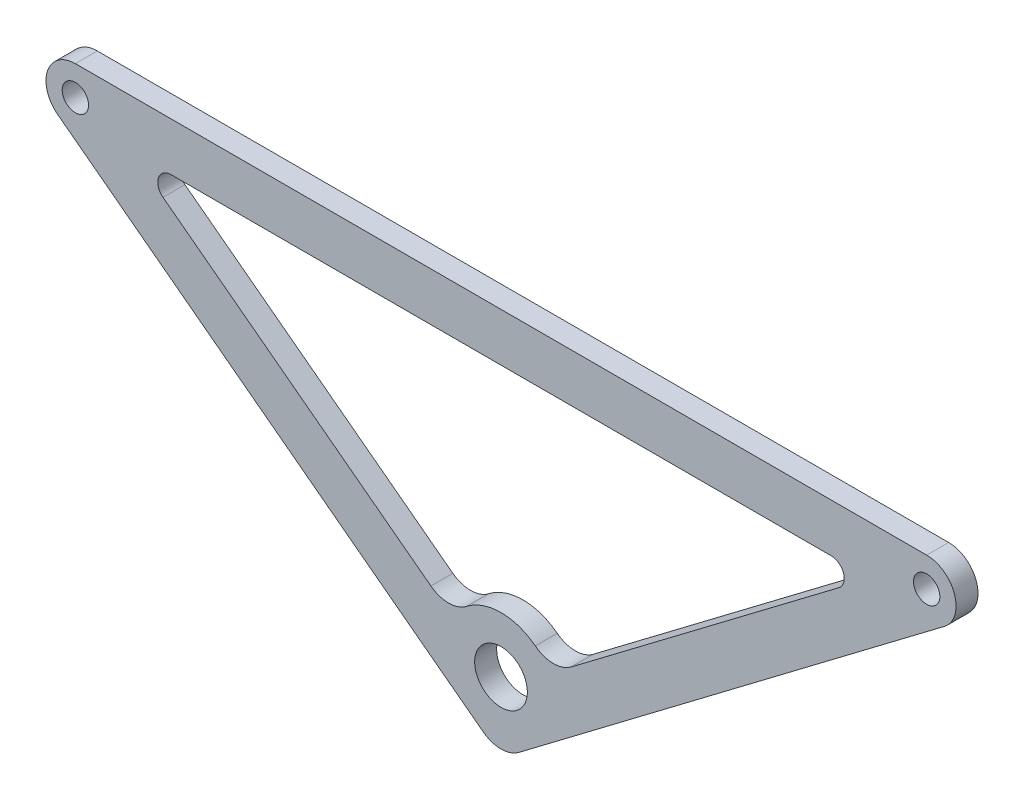
ISO-10303-21;
HEADER;
FILE_DESCRIPTION(('STEP AP214'),'2;1');
FILE_NAME('part.step','',(''),(''),'','','');
FILE_SCHEMA(('AUTOMOTIVE_DESIGN { 1 0 10303 214 1 1 1 1 }'));
ENDSEC;
DATA;
#1=APPLICATION_CONTEXT('core data for automotive mechanical design processes');
#2=APPLICATION_PROTOCOL_DEFINITION('international standard','automotive_design',2000,#1);
#3=PRODUCT_CONTEXT('',#1,'mechanical');
#4=PRODUCT('Part','Part','',(#3));
#5=PRODUCT_RELATED_PRODUCT_CATEGORY('part','',(#4));
#6=PRODUCT_DEFINITION_FORMATION('','',#4);
#7=PRODUCT_DEFINITION_CONTEXT('part definition',#1,'design');
#8=PRODUCT_DEFINITION('design','',#6,#7);
#9=PRODUCT_DEFINITION_SHAPE('','',#8);
#10=(LENGTH_UNIT() NAMED_UNIT(*) SI_UNIT(.MILLI.,.METRE.));
#11=(NAMED_UNIT(*) PLANE_ANGLE_UNIT() SI_UNIT($,.RADIAN.));
#12=(NAMED_UNIT(*) SI_UNIT($,.STERADIAN.) SOLID_ANGLE_UNIT());
#13=UNCERTAINTY_MEASURE_WITH_UNIT(LENGTH_MEASURE(1.E-05),#10,'distance_accuracy_value','');
#14=(GEOMETRIC_REPRESENTATION_CONTEXT(3) GLOBAL_UNCERTAINTY_ASSIGNED_CONTEXT((#13)) GLOBAL_UNIT_ASSIGNED_CONTEXT((#10,
#11,#12)) REPRESENTATION_CONTEXT('',''));
#15=CARTESIAN_POINT('',(0.,0.,0.));
#16=DIRECTION('',(0.,0.,1.));
#17=DIRECTION('',(1.,0.,0.));
#18=AXIS2_PLACEMENT_3D('',#15,#16,#17);
#19=CARTESIAN_POINT('',(0.,-80.,2.5));
#20=DIRECTION('',(0.,0.,1.));
#21=DIRECTION('',(1.,0.,0.));
#22=AXIS2_PLACEMENT_3D('',#19,#20,#21);
#23=PLANE('',#22);
#24=CARTESIAN_POINT('',(0.,-72.4768091251751,2.5));
#25=DIRECTION('',(0.,0.,-1.));
#26=DIRECTION('',(-1.,0.,0.));
#27=AXIS2_PLACEMENT_3D('',#24,#25,#26);
#28=CIRCLE('',#27,12.7);
#29=CARTESIAN_POINT('',(-7.80952551393194,-62.4617548943062,2.5));
#30=VERTEX_POINT('',#29);
#31=CARTESIAN_POINT('',(7.80952551393194,-62.4617548943062,2.5));
#32=VERTEX_POINT('',#31);
#33=EDGE_CURVE('E145',#30,#32,#28,.T.);
#34=ORIENTED_EDGE('',*,*,#33,.F.);
#35=CARTESIAN_POINT('',(-11.9295114149826,-57.1782223473123,2.5));
#36=DIRECTION('',(0.,0.,1.));
#37=DIRECTION('',(-1.,0.,0.));
#38=AXIS2_PLACEMENT_3D('',#35,#36,#37);
#39=CIRCLE('',#38,6.7);
#40=CARTESIAN_POINT('',(-15.9714478155139,-62.5216996920814,2.5));
#41=VERTEX_POINT('',#40);
#42=EDGE_CURVE('E137',#41,#30,#39,.T.);
#43=ORIENTED_EDGE('',*,*,#42,.F.);
#44=DIRECTION('',(0.797533932055083,-0.603274089631536,0.));
#45=VECTOR('',#44,1.);
#46=CARTESIAN_POINT('',(-76.9545423315636,-16.3926017961653,2.5));
#47=LINE('',#46,#45);
#48=CARTESIAN_POINT('',(-76.9545423315636,-16.3926017961653,2.5));
#49=VERTEX_POINT('',#48);
#50=EDGE_CURVE('E172',#49,#41,#47,.T.);
#51=ORIENTED_EDGE('',*,*,#50,.F.);
#52=CARTESIAN_POINT('',(-75.1447200626691,-14.,2.5));
#53=DIRECTION('',(0.,0.,1.));
#54=DIRECTION('',(1.,0.,0.));
#55=AXIS2_PLACEMENT_3D('',#52,#53,#54);
#56=CIRCLE('',#55,3.);
#57=CARTESIAN_POINT('',(-75.144720062669,-11.,2.5));
#58=VERTEX_POINT('',#57);
#59=EDGE_CURVE('E170',#58,#49,#56,.T.);
#60=ORIENTED_EDGE('',*,*,#59,.F.);
#61=DIRECTION('',(-1.,0.,0.));
#62=VECTOR('',#61,1.);
#63=CARTESIAN_POINT('',(75.144720062669,-11.,2.5));
#64=LINE('',#63,#62);
#65=CARTESIAN_POINT('',(75.144720062669,-11.,2.5));
#66=VERTEX_POINT('',#65);
#67=EDGE_CURVE('E168',#66,#58,#64,.T.);
#68=ORIENTED_EDGE('',*,*,#67,.F.);
#69=CARTESIAN_POINT('',(75.1447200626692,-14.,2.5));
#70=DIRECTION('',(0.,0.,1.));
#71=DIRECTION('',(-1.,0.,0.));
#72=AXIS2_PLACEMENT_3D('',#69,#70,#71);
#73=CIRCLE('',#72,3.);
#74=CARTESIAN_POINT('',(76.9545423315637,-16.3926017961653,2.5));
#75=VERTEX_POINT('',#74);
#76=EDGE_CURVE('E166',#75,#66,#73,.T.);
#77=ORIENTED_EDGE('',*,*,#76,.F.);
#78=DIRECTION('',(0.797533932055083,0.603274089631536,0.));
#79=VECTOR('',#78,1.);
#80=CARTESIAN_POINT('',(15.971447815514,-62.5216996920814,2.5));
#81=LINE('',#80,#79);
#82=CARTESIAN_POINT('',(15.971447815514,-62.5216996920814,2.5));
#83=VERTEX_POINT('',#82);
#84=EDGE_CURVE('E161',#83,#75,#81,.T.);
#85=ORIENTED_EDGE('',*,*,#84,.F.);
#86=CARTESIAN_POINT('',(11.9295114149827,-57.1782223473123,2.5));
#87=DIRECTION('',(0.,0.,1.));
#88=DIRECTION('',(1.,0.,0.));
#89=AXIS2_PLACEMENT_3D('',#86,#87,#88);
#90=CIRCLE('',#89,6.70000000000001);
#91=EDGE_CURVE('E159',#32,#83,#90,.T.);
#92=ORIENTED_EDGE('',*,*,#91,.F.);
#93=EDGE_LOOP('',(#34,#43,#51,#60,#68,#77,#85,#92));
#94=FACE_BOUND('',#93,.T.);
#95=CARTESIAN_POINT('',(-96.9090650071017,-6.69562307078791,2.5));
#96=DIRECTION('',(0.,0.,1.));
#97=DIRECTION('',(1.,0.,0.));
#98=AXIS2_PLACEMENT_3D('',#95,#96,#97);
#99=CIRCLE('',#98,3.00000000000001);
#100=CARTESIAN_POINT('',(-93.9090650071017,-6.69562307078791,2.5));
#101=VERTEX_POINT('',#100);
#102=EDGE_CURVE('E205',#101,#101,#99,.T.);
#103=ORIENTED_EDGE('',*,*,#102,.F.);
#104=EDGE_LOOP('',(#103));
#105=FACE_BOUND('',#104,.T.);
#106=CARTESIAN_POINT('',(0.,-80.,2.5));
#107=DIRECTION('',(0.,0.,1.));
#108=DIRECTION('',(1.,0.,0.));
#109=AXIS2_PLACEMENT_3D('',#106,#107,#108);
#110=CIRCLE('',#109,6.69562307078787);
#111=CARTESIAN_POINT('',(-4.03929591254546,-85.3399865952042,2.5));
#112=VERTEX_POINT('',#111);
#113=CARTESIAN_POINT('',(4.03929591254546,-85.3399865952042,2.5));
#114=VERTEX_POINT('',#113);
#115=EDGE_CURVE('E217',#112,#114,#110,.T.);
#116=ORIENTED_EDGE('',*,*,#115,.T.);
#117=DIRECTION('',(0.797533932055084,0.603274089631535,0.));
#118=VECTOR('',#117,1.);
#119=CARTESIAN_POINT('',(4.03929591254546,-85.3399865952042,2.5));
#120=LINE('',#119,#118);
#121=CARTESIAN_POINT('',(100.948360919647,-12.0356096659921,2.5));
#122=VERTEX_POINT('',#121);
#123=EDGE_CURVE('E220',#114,#122,#120,.T.);
#124=ORIENTED_EDGE('',*,*,#123,.T.);
#125=CARTESIAN_POINT('',(96.9090650071017,-6.69562307078791,2.5));
#126=DIRECTION('',(0.,0.,1.));
#127=DIRECTION('',(-1.,0.,0.));
#128=AXIS2_PLACEMENT_3D('',#125,#126,#127);
#129=CIRCLE('',#128,6.69562307078788);
#130=CARTESIAN_POINT('',(96.9090650071017,0.,2.5));
#131=VERTEX_POINT('',#130);
#132=EDGE_CURVE('E223',#122,#131,#129,.T.);
#133=ORIENTED_EDGE('',*,*,#132,.T.);
#134=DIRECTION('',(-1.,0.,0.));
#135=VECTOR('',#134,1.);
#136=CARTESIAN_POINT('',(96.9090650071017,0.,2.5));
#137=LINE('',#136,#135);
#138=CARTESIAN_POINT('',(-96.9090650071013,0.,2.5));
#139=VERTEX_POINT('',#138);
#140=EDGE_CURVE('E225',#131,#139,#137,.T.);
#141=ORIENTED_EDGE('',*,*,#140,.T.);
#142=CARTESIAN_POINT('',(-96.9090650071017,-6.69562307078791,2.5));
#143=DIRECTION('',(0.,0.,1.));
#144=DIRECTION('',(1.,0.,0.));
#145=AXIS2_PLACEMENT_3D('',#142,#143,#144);
#146=CIRCLE('',#145,6.69562307078777);
#147=CARTESIAN_POINT('',(-100.948360919647,-12.0356096659922,2.5));
#148=VERTEX_POINT('',#147);
#149=EDGE_CURVE('E227',#139,#148,#146,.T.);
#150=ORIENTED_EDGE('',*,*,#149,.T.);
#151=DIRECTION('',(0.797533932055083,-0.603274089631536,0.));
#152=VECTOR('',#151,1.);
#153=CARTESIAN_POINT('',(-100.948360919647,-12.0356096659921,2.5));
#154=LINE('',#153,#152);
#155=EDGE_CURVE('E229',#148,#112,#154,.T.);
#156=ORIENTED_EDGE('',*,*,#155,.T.);
#157=EDGE_LOOP('',(#116,#124,#133,#141,#150,#156));
#158=FACE_BOUND('',#157,.T.);
#159=CARTESIAN_POINT('',(96.9090650071017,-6.69562307078791,2.5));
#160=DIRECTION('',(0.,0.,1.));
#161=DIRECTION('',(1.,0.,0.));
#162=AXIS2_PLACEMENT_3D('',#159,#160,#161);
#163=CIRCLE('',#162,3.00000000000001);
#164=CARTESIAN_POINT('',(99.9090650071017,-6.69562307078791,2.5));
#165=VERTEX_POINT('',#164);
#166=EDGE_CURVE('E211',#165,#165,#163,.T.);
#167=ORIENTED_EDGE('',*,*,#166,.F.);
#168=EDGE_LOOP('',(#167));
#169=FACE_BOUND('',#168,.T.);
#170=CARTESIAN_POINT('',(0.,-72.4768091251751,2.5));
#171=DIRECTION('',(0.,0.,1.));
#172=DIRECTION('',(1.,0.,0.));
#173=AXIS2_PLACEMENT_3D('',#170,#171,#172);
#174=CIRCLE('',#173,6.);
#175=CARTESIAN_POINT('',(6.,-72.4768091251751,2.5));
#176=VERTEX_POINT('',#175);
#177=EDGE_CURVE('E175',#176,#176,#174,.T.);
#178=ORIENTED_EDGE('',*,*,#177,.F.);
#179=EDGE_LOOP('',(#178));
#180=FACE_BOUND('',#179,.T.);
#181=ADVANCED_FACE('F36',(#94,#105,#158,#169,#180),#23,.T.);
#182=CARTESIAN_POINT('',(0.,-80.,-2.5));
#183=DIRECTION('',(0.,0.,1.));
#184=DIRECTION('',(1.,0.,0.));
#185=AXIS2_PLACEMENT_3D('',#182,#183,#184);
#186=PLANE('',#185);
#187=CARTESIAN_POINT('',(-96.9090650071017,-6.69562307078791,-2.5));
#188=DIRECTION('',(0.,0.,1.));
#189=DIRECTION('',(1.,0.,0.));
#190=AXIS2_PLACEMENT_3D('',#187,#188,#189);
#191=CIRCLE('',#190,3.00000000000001);
#192=CARTESIAN_POINT('',(-93.9090650071017,-6.69562307078791,-2.5));
#193=VERTEX_POINT('',#192);
#194=EDGE_CURVE('E153',#193,#193,#191,.T.);
#195=ORIENTED_EDGE('',*,*,#194,.T.);
#196=EDGE_LOOP('',(#195));
#197=FACE_BOUND('',#196,.T.);
#198=CARTESIAN_POINT('',(96.9090650071017,-6.69562307078791,-2.5));
#199=DIRECTION('',(0.,0.,1.));
#200=DIRECTION('',(1.,0.,0.));
#201=AXIS2_PLACEMENT_3D('',#198,#199,#200);
#202=CIRCLE('',#201,3.00000000000001);
#203=CARTESIAN_POINT('',(99.9090650071017,-6.69562307078791,-2.5));
#204=VERTEX_POINT('',#203);
#205=EDGE_CURVE('E208',#204,#204,#202,.T.);
#206=ORIENTED_EDGE('',*,*,#205,.T.);
#207=EDGE_LOOP('',(#206));
#208=FACE_BOUND('',#207,.T.);
#209=CARTESIAN_POINT('',(0.,-80.,-2.5));
#210=DIRECTION('',(0.,0.,1.));
#211=DIRECTION('',(1.,0.,0.));
#212=AXIS2_PLACEMENT_3D('',#209,#210,#211);
#213=CIRCLE('',#212,6.69562307078787);
#214=CARTESIAN_POINT('',(-4.03929591254546,-85.3399865952042,-2.5));
#215=VERTEX_POINT('',#214);
#216=CARTESIAN_POINT('',(4.03929591254546,-85.3399865952042,-2.5));
#217=VERTEX_POINT('',#216);
#218=EDGE_CURVE('E214',#215,#217,#213,.T.);
#219=ORIENTED_EDGE('',*,*,#218,.F.);
#220=DIRECTION('',(0.797533932055083,-0.603274089631536,0.));
#221=VECTOR('',#220,1.);
#222=CARTESIAN_POINT('',(-100.948360919647,-12.0356096659921,-2.5));
#223=LINE('',#222,#221);
#224=CARTESIAN_POINT('',(-100.948360919647,-12.0356096659922,-2.5));
#225=VERTEX_POINT('',#224);
#226=EDGE_CURVE('E221',#225,#215,#223,.T.);
#227=ORIENTED_EDGE('',*,*,#226,.F.);
#228=CARTESIAN_POINT('',(-96.9090650071017,-6.69562307078791,-2.5));
#229=DIRECTION('',(0.,0.,1.));
#230=DIRECTION('',(1.,0.,0.));
#231=AXIS2_PLACEMENT_3D('',#228,#229,#230);
#232=CIRCLE('',#231,6.69562307078777);
#233=CARTESIAN_POINT('',(-96.9090650071013,0.,-2.5));
#234=VERTEX_POINT('',#233);
#235=EDGE_CURVE('E240',#234,#225,#232,.T.);
#236=ORIENTED_EDGE('',*,*,#235,.F.);
#237=DIRECTION('',(-1.,0.,0.));
#238=VECTOR('',#237,1.);
#239=CARTESIAN_POINT('',(96.9090650071017,0.,-2.5));
#240=LINE('',#239,#238);
#241=CARTESIAN_POINT('',(96.9090650071017,0.,-2.5));
#242=VERTEX_POINT('',#241);
#243=EDGE_CURVE('E238',#242,#234,#240,.T.);
#244=ORIENTED_EDGE('',*,*,#243,.F.);
#245=CARTESIAN_POINT('',(96.9090650071017,-6.69562307078791,-2.5));
#246=DIRECTION('',(0.,0.,1.));
#247=DIRECTION('',(-1.,0.,0.));
#248=AXIS2_PLACEMENT_3D('',#245,#246,#247);
#249=CIRCLE('',#248,6.69562307078788);
#250=CARTESIAN_POINT('',(100.948360919647,-12.0356096659921,-2.5));
#251=VERTEX_POINT('',#250);
#252=EDGE_CURVE('E236',#251,#242,#249,.T.);
#253=ORIENTED_EDGE('',*,*,#252,.F.);
#254=DIRECTION('',(0.797533932055084,0.603274089631535,0.));
#255=VECTOR('',#254,1.);
#256=CARTESIAN_POINT('',(4.03929591254546,-85.3399865952042,-2.5));
#257=LINE('',#256,#255);
#258=EDGE_CURVE('E234',#217,#251,#257,.T.);
#259=ORIENTED_EDGE('',*,*,#258,.F.);
#260=EDGE_LOOP('',(#219,#227,#236,#244,#253,#259));
#261=FACE_BOUND('',#260,.T.);
#262=CARTESIAN_POINT('',(-11.9295114149826,-57.1782223473123,-2.5));
#263=DIRECTION('',(0.,0.,1.));
#264=DIRECTION('',(-1.,0.,0.));
#265=AXIS2_PLACEMENT_3D('',#262,#263,#264);
#266=CIRCLE('',#265,6.7);
#267=CARTESIAN_POINT('',(-15.9714478155139,-62.5216996920814,-2.5));
#268=VERTEX_POINT('',#267);
#269=CARTESIAN_POINT('',(-7.80952551393194,-62.4617548943062,-2.5));
#270=VERTEX_POINT('',#269);
#271=EDGE_CURVE('E59',#268,#270,#266,.T.);
#272=ORIENTED_EDGE('',*,*,#271,.T.);
#273=CARTESIAN_POINT('',(0.,-72.4768091251751,-2.5));
#274=DIRECTION('',(0.,0.,-1.));
#275=DIRECTION('',(-1.,0.,0.));
#276=AXIS2_PLACEMENT_3D('',#273,#274,#275);
#277=CIRCLE('',#276,12.7);
#278=CARTESIAN_POINT('',(7.80952551393194,-62.4617548943062,-2.5));
#279=VERTEX_POINT('',#278);
#280=EDGE_CURVE('E152',#270,#279,#277,.T.);
#281=ORIENTED_EDGE('',*,*,#280,.T.);
#282=CARTESIAN_POINT('',(11.9295114149827,-57.1782223473123,-2.5));
#283=DIRECTION('',(0.,0.,1.));
#284=DIRECTION('',(1.,0.,0.));
#285=AXIS2_PLACEMENT_3D('',#282,#283,#284);
#286=CIRCLE('',#285,6.70000000000001);
#287=CARTESIAN_POINT('',(15.971447815514,-62.5216996920814,-2.5));
#288=VERTEX_POINT('',#287);
#289=EDGE_CURVE('E177',#279,#288,#286,.T.);
#290=ORIENTED_EDGE('',*,*,#289,.T.);
#291=DIRECTION('',(0.797533932055083,0.603274089631536,0.));
#292=VECTOR('',#291,1.);
#293=CARTESIAN_POINT('',(15.971447815514,-62.5216996920814,-2.5));
#294=LINE('',#293,#292);
#295=CARTESIAN_POINT('',(76.9545423315637,-16.3926017961653,-2.5));
#296=VERTEX_POINT('',#295);
#297=EDGE_CURVE('E180',#288,#296,#294,.T.);
#298=ORIENTED_EDGE('',*,*,#297,.T.);
#299=CARTESIAN_POINT('',(75.1447200626692,-14.,-2.5));
#300=DIRECTION('',(0.,0.,1.));
#301=DIRECTION('',(-1.,0.,0.));
#302=AXIS2_PLACEMENT_3D('',#299,#300,#301);
#303=CIRCLE('',#302,3.);
#304=CARTESIAN_POINT('',(75.144720062669,-11.,-2.5));
#305=VERTEX_POINT('',#304);
#306=EDGE_CURVE('E183',#296,#305,#303,.T.);
#307=ORIENTED_EDGE('',*,*,#306,.T.);
#308=DIRECTION('',(-1.,0.,0.));
#309=VECTOR('',#308,1.);
#310=CARTESIAN_POINT('',(75.144720062669,-11.,-2.5));
#311=LINE('',#310,#309);
#312=CARTESIAN_POINT('',(-75.144720062669,-11.,-2.5));
#313=VERTEX_POINT('',#312);
#314=EDGE_CURVE('E186',#305,#313,#311,.T.);
#315=ORIENTED_EDGE('',*,*,#314,.T.);
#316=CARTESIAN_POINT('',(-75.1447200626691,-14.,-2.5));
#317=DIRECTION('',(0.,0.,1.));
#318=DIRECTION('',(1.,0.,0.));
#319=AXIS2_PLACEMENT_3D('',#316,#317,#318);
#320=CIRCLE('',#319,3.);
#321=CARTESIAN_POINT('',(-76.9545423315636,-16.3926017961653,-2.5));
#322=VERTEX_POINT('',#321);
#323=EDGE_CURVE('E189',#313,#322,#320,.T.);
#324=ORIENTED_EDGE('',*,*,#323,.T.);
#325=DIRECTION('',(0.797533932055083,-0.603274089631536,0.));
#326=VECTOR('',#325,1.);
#327=CARTESIAN_POINT('',(-76.9545423315636,-16.3926017961653,-2.5));
#328=LINE('',#327,#326);
#329=EDGE_CURVE('E146',#322,#268,#328,.T.);
#330=ORIENTED_EDGE('',*,*,#329,.T.);
#331=EDGE_LOOP('',(#272,#281,#290,#298,#307,#315,#324,#330));
#332=FACE_BOUND('',#331,.T.);
#333=CARTESIAN_POINT('',(0.,-72.4768091251751,-2.5));
#334=DIRECTION('',(0.,0.,1.));
#335=DIRECTION('',(1.,0.,0.));
#336=AXIS2_PLACEMENT_3D('',#333,#334,#335);
#337=CIRCLE('',#336,6.);
#338=CARTESIAN_POINT('',(6.,-72.4768091251751,-2.5));
#339=VERTEX_POINT('',#338);
#340=EDGE_CURVE('E345',#339,#339,#337,.T.);
#341=ORIENTED_EDGE('',*,*,#340,.T.);
#342=EDGE_LOOP('',(#341));
#343=FACE_BOUND('',#342,.T.);
#344=ADVANCED_FACE('F264',(#197,#208,#261,#332,#343),#186,.F.);
#345=CARTESIAN_POINT('',(0.,-80.,2.5));
#346=DIRECTION('',(0.,0.,-1.));
#347=DIRECTION('',(-1.,0.,0.));
#348=AXIS2_PLACEMENT_3D('',#345,#346,#347);
#349=CYLINDRICAL_SURFACE('',#348,6.69562307078787);
#350=ORIENTED_EDGE('',*,*,#218,.T.);
#351=DIRECTION('',(0.,0.,-1.));
#352=VECTOR('',#351,1.);
#353=CARTESIAN_POINT('',(4.03929591254546,-85.3399865952042,2.5));
#354=LINE('',#353,#352);
#355=EDGE_CURVE('E11',#114,#217,#354,.T.);
#356=ORIENTED_EDGE('',*,*,#355,.F.);
#357=ORIENTED_EDGE('',*,*,#115,.F.);
#358=DIRECTION('',(0.,0.,-1.));
#359=VECTOR('',#358,1.);
#360=CARTESIAN_POINT('',(-4.03929591254546,-85.3399865952042,2.5));
#361=LINE('',#360,#359);
#362=EDGE_CURVE('E231',#112,#215,#361,.T.);
#363=ORIENTED_EDGE('',*,*,#362,.T.);
#364=EDGE_LOOP('',(#350,#356,#357,#363));
#365=FACE_BOUND('',#364,.T.);
#366=ADVANCED_FACE('F38',(#365),#349,.T.);
#367=CARTESIAN_POINT('',(4.03929591254546,-85.3399865952042,2.5));
#368=DIRECTION('',(-0.603274089631535,0.797533932055084,0.));
#369=DIRECTION('',(-0.797533932055084,-0.603274089631535,0.));
#370=AXIS2_PLACEMENT_3D('',#367,#368,#369);
#371=PLANE('',#370);
#372=ORIENTED_EDGE('',*,*,#258,.T.);
#373=DIRECTION('',(0.,0.,-1.));
#374=VECTOR('',#373,1.);
#375=CARTESIAN_POINT('',(100.948360919647,-12.0356096659921,2.5));
#376=LINE('',#375,#374);
#377=EDGE_CURVE('E44',#122,#251,#376,.T.);
#378=ORIENTED_EDGE('',*,*,#377,.F.);
#379=ORIENTED_EDGE('',*,*,#123,.F.);
#380=ORIENTED_EDGE('',*,*,#355,.T.);
#381=EDGE_LOOP('',(#372,#378,#379,#380));
#382=FACE_BOUND('',#381,.T.);
#383=ADVANCED_FACE('F282',(#382),#371,.F.);
#384=CARTESIAN_POINT('',(96.9090650071017,-6.69562307078791,2.5));
#385=DIRECTION('',(0.,0.,-1.));
#386=DIRECTION('',(-1.,0.,0.));
#387=AXIS2_PLACEMENT_3D('',#384,#385,#386);
#388=CYLINDRICAL_SURFACE('',#387,6.69562307078788);
#389=ORIENTED_EDGE('',*,*,#252,.T.);
#390=DIRECTION('',(0.,0.,-1.));
#391=VECTOR('',#390,1.);
#392=CARTESIAN_POINT('',(96.9090650071017,0.,2.5));
#393=LINE('',#392,#391);
#394=EDGE_CURVE('E251',#131,#242,#393,.T.);
#395=ORIENTED_EDGE('',*,*,#394,.F.);
#396=ORIENTED_EDGE('',*,*,#132,.F.);
#397=ORIENTED_EDGE('',*,*,#377,.T.);
#398=EDGE_LOOP('',(#389,#395,#396,#397));
#399=FACE_BOUND('',#398,.T.);
#400=ADVANCED_FACE('F258',(#399),#388,.T.);
#401=CARTESIAN_POINT('',(96.9090650071017,0.,2.5));
#402=DIRECTION('',(0.,-1.,0.));
#403=DIRECTION('',(1.,0.,0.));
#404=AXIS2_PLACEMENT_3D('',#401,#402,#403);
#405=PLANE('',#404);
#406=ORIENTED_EDGE('',*,*,#243,.T.);
#407=DIRECTION('',(0.,0.,-1.));
#408=VECTOR('',#407,1.);
#409=CARTESIAN_POINT('',(-96.9090650071013,0.,2.5));
#410=LINE('',#409,#408);
#411=EDGE_CURVE('E248',#139,#234,#410,.T.);
#412=ORIENTED_EDGE('',*,*,#411,.F.);
#413=ORIENTED_EDGE('',*,*,#140,.F.);
#414=ORIENTED_EDGE('',*,*,#394,.T.);
#415=EDGE_LOOP('',(#406,#412,#413,#414));
#416=FACE_BOUND('',#415,.T.);
#417=ADVANCED_FACE('F270',(#416),#405,.F.);
#418=CARTESIAN_POINT('',(-96.9090650071017,-6.69562307078791,2.5));
#419=DIRECTION('',(0.,0.,-1.));
#420=DIRECTION('',(-1.,0.,0.));
#421=AXIS2_PLACEMENT_3D('',#418,#419,#420);
#422=CYLINDRICAL_SURFACE('',#421,6.69562307078777);
#423=ORIENTED_EDGE('',*,*,#235,.T.);
#424=DIRECTION('',(0.,0.,-1.));
#425=VECTOR('',#424,1.);
#426=CARTESIAN_POINT('',(-100.948360919647,-12.0356096659922,2.5));
#427=LINE('',#426,#425);
#428=EDGE_CURVE('E245',#148,#225,#427,.T.);
#429=ORIENTED_EDGE('',*,*,#428,.F.);
#430=ORIENTED_EDGE('',*,*,#149,.F.);
#431=ORIENTED_EDGE('',*,*,#411,.T.);
#432=EDGE_LOOP('',(#423,#429,#430,#431));
#433=FACE_BOUND('',#432,.T.);
#434=ADVANCED_FACE('F274',(#433),#422,.T.);
#435=CARTESIAN_POINT('',(-100.948360919647,-12.0356096659921,2.5));
#436=DIRECTION('',(0.603274089631536,0.797533932055083,0.));
#437=DIRECTION('',(-0.797533932055083,0.603274089631536,0.));
#438=AXIS2_PLACEMENT_3D('',#435,#436,#437);
#439=PLANE('',#438);
#440=ORIENTED_EDGE('',*,*,#226,.T.);
#441=ORIENTED_EDGE('',*,*,#362,.F.);
#442=ORIENTED_EDGE('',*,*,#155,.F.);
#443=ORIENTED_EDGE('',*,*,#428,.T.);
#444=EDGE_LOOP('',(#440,#441,#442,#443));
#445=FACE_BOUND('',#444,.T.);
#446=ADVANCED_FACE('F285',(#445),#439,.F.);
#447=CARTESIAN_POINT('',(96.9090650071017,-6.69562307078791,2.5));
#448=DIRECTION('',(0.,0.,-1.));
#449=DIRECTION('',(-1.,0.,0.));
#450=AXIS2_PLACEMENT_3D('',#447,#448,#449);
#451=CYLINDRICAL_SURFACE('',#450,3.00000000000001);
#452=ORIENTED_EDGE('',*,*,#166,.T.);
#453=EDGE_LOOP('',(#452));
#454=FACE_BOUND('',#453,.T.);
#455=ORIENTED_EDGE('',*,*,#205,.F.);
#456=EDGE_LOOP('',(#455));
#457=FACE_BOUND('',#456,.T.);
#458=ADVANCED_FACE('F287',(#454,#457),#451,.F.);
#459=CARTESIAN_POINT('',(-96.9090650071017,-6.69562307078791,2.5));
#460=DIRECTION('',(0.,0.,-1.));
#461=DIRECTION('',(-1.,0.,0.));
#462=AXIS2_PLACEMENT_3D('',#459,#460,#461);
#463=CYLINDRICAL_SURFACE('',#462,3.00000000000001);
#464=ORIENTED_EDGE('',*,*,#102,.T.);
#465=EDGE_LOOP('',(#464));
#466=FACE_BOUND('',#465,.T.);
#467=ORIENTED_EDGE('',*,*,#194,.F.);
#468=EDGE_LOOP('',(#467));
#469=FACE_BOUND('',#468,.T.);
#470=ADVANCED_FACE('F293',(#466,#469),#463,.F.);
#471=CARTESIAN_POINT('',(-11.9295114149826,-57.1782223473123,2.5));
#472=DIRECTION('',(0.,0.,-1.));
#473=DIRECTION('',(-1.,0.,0.));
#474=AXIS2_PLACEMENT_3D('',#471,#472,#473);
#475=CYLINDRICAL_SURFACE('',#474,6.7);
#476=ORIENTED_EDGE('',*,*,#271,.F.);
#477=DIRECTION('',(0.,0.,-1.));
#478=VECTOR('',#477,1.);
#479=CARTESIAN_POINT('',(-15.9714478155139,-62.5216996920814,2.5));
#480=LINE('',#479,#478);
#481=EDGE_CURVE('E141',#41,#268,#480,.T.);
#482=ORIENTED_EDGE('',*,*,#481,.F.);
#483=ORIENTED_EDGE('',*,*,#42,.T.);
#484=DIRECTION('',(0.,0.,-1.));
#485=VECTOR('',#484,1.);
#486=CARTESIAN_POINT('',(-7.80952551393194,-62.4617548943062,2.5));
#487=LINE('',#486,#485);
#488=EDGE_CURVE('E140',#30,#270,#487,.T.);
#489=ORIENTED_EDGE('',*,*,#488,.T.);
#490=EDGE_LOOP('',(#476,#482,#483,#489));
#491=FACE_BOUND('',#490,.T.);
#492=ADVANCED_FACE('F139',(#491),#475,.F.);
#493=CARTESIAN_POINT('',(0.,-72.4768091251751,2.5));
#494=DIRECTION('',(0.,0.,-1.));
#495=DIRECTION('',(-1.,0.,0.));
#496=AXIS2_PLACEMENT_3D('',#493,#494,#495);
#497=CYLINDRICAL_SURFACE('',#496,12.7);
#498=ORIENTED_EDGE('',*,*,#280,.F.);
#499=ORIENTED_EDGE('',*,*,#488,.F.);
#500=ORIENTED_EDGE('',*,*,#33,.T.);
#501=DIRECTION('',(0.,0.,-1.));
#502=VECTOR('',#501,1.);
#503=CARTESIAN_POINT('',(7.80952551393194,-62.4617548943062,2.5));
#504=LINE('',#503,#502);
#505=EDGE_CURVE('E154',#32,#279,#504,.T.);
#506=ORIENTED_EDGE('',*,*,#505,.T.);
#507=EDGE_LOOP('',(#498,#499,#500,#506));
#508=FACE_BOUND('',#507,.T.);
#509=ADVANCED_FACE('F149',(#508),#497,.T.);
#510=CARTESIAN_POINT('',(11.9295114149827,-57.1782223473123,2.5));
#511=DIRECTION('',(0.,0.,-1.));
#512=DIRECTION('',(-1.,0.,0.));
#513=AXIS2_PLACEMENT_3D('',#510,#511,#512);
#514=CYLINDRICAL_SURFACE('',#513,6.70000000000001);
#515=ORIENTED_EDGE('',*,*,#289,.F.);
#516=ORIENTED_EDGE('',*,*,#505,.F.);
#517=ORIENTED_EDGE('',*,*,#91,.T.);
#518=DIRECTION('',(0.,0.,-1.));
#519=VECTOR('',#518,1.);
#520=CARTESIAN_POINT('',(15.971447815514,-62.5216996920814,2.5));
#521=LINE('',#520,#519);
#522=EDGE_CURVE('E202',#83,#288,#521,.T.);
#523=ORIENTED_EDGE('',*,*,#522,.T.);
#524=EDGE_LOOP('',(#515,#516,#517,#523));
#525=FACE_BOUND('',#524,.T.);
#526=ADVANCED_FACE('F312',(#525),#514,.F.);
#527=CARTESIAN_POINT('',(15.971447815514,-62.5216996920814,2.5));
#528=DIRECTION('',(-0.603274089631536,0.797533932055083,0.));
#529=DIRECTION('',(-0.797533932055083,-0.603274089631536,0.));
#530=AXIS2_PLACEMENT_3D('',#527,#528,#529);
#531=PLANE('',#530);
#532=ORIENTED_EDGE('',*,*,#297,.F.);
#533=ORIENTED_EDGE('',*,*,#522,.F.);
#534=ORIENTED_EDGE('',*,*,#84,.T.);
#535=DIRECTION('',(0.,0.,-1.));
#536=VECTOR('',#535,1.);
#537=CARTESIAN_POINT('',(76.9545423315637,-16.3926017961653,2.5));
#538=LINE('',#537,#536);
#539=EDGE_CURVE('E200',#75,#296,#538,.T.);
#540=ORIENTED_EDGE('',*,*,#539,.T.);
#541=EDGE_LOOP('',(#532,#533,#534,#540));
#542=FACE_BOUND('',#541,.T.);
#543=ADVANCED_FACE('F315',(#542),#531,.T.);
#544=CARTESIAN_POINT('',(75.1447200626692,-14.,2.5));
#545=DIRECTION('',(0.,0.,-1.));
#546=DIRECTION('',(-1.,0.,0.));
#547=AXIS2_PLACEMENT_3D('',#544,#545,#546);
#548=CYLINDRICAL_SURFACE('',#547,3.);
#549=ORIENTED_EDGE('',*,*,#306,.F.);
#550=ORIENTED_EDGE('',*,*,#539,.F.);
#551=ORIENTED_EDGE('',*,*,#76,.T.);
#552=DIRECTION('',(0.,0.,-1.));
#553=VECTOR('',#552,1.);
#554=CARTESIAN_POINT('',(75.144720062669,-11.,2.5));
#555=LINE('',#554,#553);
#556=EDGE_CURVE('E198',#66,#305,#555,.T.);
#557=ORIENTED_EDGE('',*,*,#556,.T.);
#558=EDGE_LOOP('',(#549,#550,#551,#557));
#559=FACE_BOUND('',#558,.T.);
#560=ADVANCED_FACE('F319',(#559),#548,.F.);
#561=CARTESIAN_POINT('',(75.144720062669,-11.,2.5));
#562=DIRECTION('',(0.,-1.,0.));
#563=DIRECTION('',(1.,0.,0.));
#564=AXIS2_PLACEMENT_3D('',#561,#562,#563);
#565=PLANE('',#564);
#566=ORIENTED_EDGE('',*,*,#314,.F.);
#567=ORIENTED_EDGE('',*,*,#556,.F.);
#568=ORIENTED_EDGE('',*,*,#67,.T.);
#569=DIRECTION('',(0.,0.,-1.));
#570=VECTOR('',#569,1.);
#571=CARTESIAN_POINT('',(-75.144720062669,-11.,2.5));
#572=LINE('',#571,#570);
#573=EDGE_CURVE('E196',#58,#313,#572,.T.);
#574=ORIENTED_EDGE('',*,*,#573,.T.);
#575=EDGE_LOOP('',(#566,#567,#568,#574));
#576=FACE_BOUND('',#575,.T.);
#577=ADVANCED_FACE('F323',(#576),#565,.T.);
#578=CARTESIAN_POINT('',(-75.1447200626691,-14.,2.5));
#579=DIRECTION('',(0.,0.,-1.));
#580=DIRECTION('',(-1.,0.,0.));
#581=AXIS2_PLACEMENT_3D('',#578,#579,#580);
#582=CYLINDRICAL_SURFACE('',#581,3.);
#583=ORIENTED_EDGE('',*,*,#323,.F.);
#584=ORIENTED_EDGE('',*,*,#573,.F.);
#585=ORIENTED_EDGE('',*,*,#59,.T.);
#586=DIRECTION('',(0.,0.,-1.));
#587=VECTOR('',#586,1.);
#588=CARTESIAN_POINT('',(-76.9545423315636,-16.3926017961653,2.5));
#589=LINE('',#588,#587);
#590=EDGE_CURVE('E51',#49,#322,#589,.T.);
#591=ORIENTED_EDGE('',*,*,#590,.T.);
#592=EDGE_LOOP('',(#583,#584,#585,#591));
#593=FACE_BOUND('',#592,.T.);
#594=ADVANCED_FACE('F327',(#593),#582,.F.);
#595=CARTESIAN_POINT('',(-76.9545423315636,-16.3926017961653,2.5));
#596=DIRECTION('',(0.603274089631536,0.797533932055083,0.));
#597=DIRECTION('',(-0.797533932055083,0.603274089631536,0.));
#598=AXIS2_PLACEMENT_3D('',#595,#596,#597);
#599=PLANE('',#598);
#600=ORIENTED_EDGE('',*,*,#329,.F.);
#601=ORIENTED_EDGE('',*,*,#590,.F.);
#602=ORIENTED_EDGE('',*,*,#50,.T.);
#603=ORIENTED_EDGE('',*,*,#481,.T.);
#604=EDGE_LOOP('',(#600,#601,#602,#603));
#605=FACE_BOUND('',#604,.T.);
#606=ADVANCED_FACE('F331',(#605),#599,.T.);
#607=CARTESIAN_POINT('',(0.,-72.4768091251751,2.5));
#608=DIRECTION('',(0.,0.,-1.));
#609=DIRECTION('',(-1.,0.,0.));
#610=AXIS2_PLACEMENT_3D('',#607,#608,#609);
#611=CYLINDRICAL_SURFACE('',#610,6.);
#612=ORIENTED_EDGE('',*,*,#177,.T.);
#613=EDGE_LOOP('',(#612));
#614=FACE_BOUND('',#613,.T.);
#615=ORIENTED_EDGE('',*,*,#340,.F.);
#616=EDGE_LOOP('',(#615));
#617=FACE_BOUND('',#616,.T.);
#618=ADVANCED_FACE('F335',(#614,#617),#611,.F.);
#619=CLOSED_SHELL('',(#181,#344,#366,#383,#400,#417,#434,#446,#458,#470,#492,#509,#526,#543,
#560,#577,#594,#606,#618));
#620=MANIFOLD_SOLID_BREP('B2',#619);
#621=ADVANCED_BREP_SHAPE_REPRESENTATION('',(#18,#620),#14);
#622=SHAPE_DEFINITION_REPRESENTATION(#9,#621);
ENDSEC;
END-ISO-10303-21;
